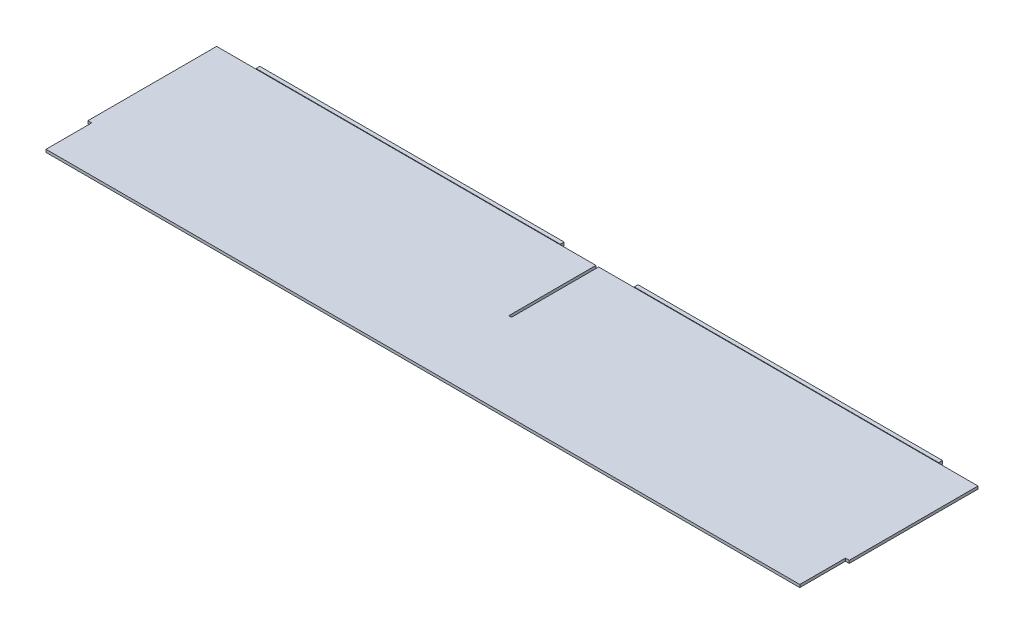
ISO-10303-21;
HEADER;
FILE_DESCRIPTION(('STEP AP214'),'2;1');
FILE_NAME('part.step','',(''),(''),'','','');
FILE_SCHEMA(('AUTOMOTIVE_DESIGN { 1 0 10303 214 1 1 1 1 }'));
ENDSEC;
DATA;
#1=APPLICATION_CONTEXT('core data for automotive mechanical design processes');
#2=APPLICATION_PROTOCOL_DEFINITION('international standard','automotive_design',2000,#1);
#3=PRODUCT_CONTEXT('',#1,'mechanical');
#4=PRODUCT('Part','Part','',(#3));
#5=PRODUCT_RELATED_PRODUCT_CATEGORY('part','',(#4));
#6=PRODUCT_DEFINITION_FORMATION('','',#4);
#7=PRODUCT_DEFINITION_CONTEXT('part definition',#1,'design');
#8=PRODUCT_DEFINITION('design','',#6,#7);
#9=PRODUCT_DEFINITION_SHAPE('','',#8);
#10=(LENGTH_UNIT() NAMED_UNIT(*) SI_UNIT(.MILLI.,.METRE.));
#11=(NAMED_UNIT(*) PLANE_ANGLE_UNIT() SI_UNIT($,.RADIAN.));
#12=(NAMED_UNIT(*) SI_UNIT($,.STERADIAN.) SOLID_ANGLE_UNIT());
#13=UNCERTAINTY_MEASURE_WITH_UNIT(LENGTH_MEASURE(1.E-05),#10,'distance_accuracy_value','');
#14=(GEOMETRIC_REPRESENTATION_CONTEXT(3) GLOBAL_UNCERTAINTY_ASSIGNED_CONTEXT((#13)) GLOBAL_UNIT_ASSIGNED_CONTEXT((#10,
#11,#12)) REPRESENTATION_CONTEXT('',''));
#15=CARTESIAN_POINT('',(0.,0.,0.));
#16=DIRECTION('',(0.,0.,1.));
#17=DIRECTION('',(1.,0.,0.));
#18=AXIS2_PLACEMENT_3D('',#15,#16,#17);
#19=CARTESIAN_POINT('',(-317.6778,1.143,-72.771));
#20=DIRECTION('',(0.,0.,1.));
#21=DIRECTION('',(1.,0.,0.));
#22=AXIS2_PLACEMENT_3D('',#19,#20,#21);
#23=PLANE('',#22);
#24=DIRECTION('',(-1.,0.,0.));
#25=VECTOR('',#24,1.);
#26=CARTESIAN_POINT('',(-317.6778,1.143,-72.771));
#27=LINE('',#26,#25);
#28=CARTESIAN_POINT('',(-1.14299999999998,1.143,-72.771));
#29=VERTEX_POINT('',#28);
#30=CARTESIAN_POINT('',(-30.8229000000015,1.143,-72.771));
#31=VERTEX_POINT('',#30);
#32=EDGE_CURVE('E200',#29,#31,#27,.T.);
#33=ORIENTED_EDGE('',*,*,#32,.F.);
#34=DIRECTION('',(0.,-1.,0.));
#35=VECTOR('',#34,1.);
#36=CARTESIAN_POINT('',(-1.14300000000001,1.143,-72.771));
#37=LINE('',#36,#35);
#38=CARTESIAN_POINT('',(-1.14299999999998,-1.143,-72.771));
#39=VERTEX_POINT('',#38);
#40=EDGE_CURVE('E11',#29,#39,#37,.T.);
#41=ORIENTED_EDGE('',*,*,#40,.T.);
#42=DIRECTION('',(-1.,0.,0.));
#43=VECTOR('',#42,1.);
#44=CARTESIAN_POINT('',(-317.6778,-1.143,-72.771));
#45=LINE('',#44,#43);
#46=CARTESIAN_POINT('',(-30.8229000000015,-1.143,-72.771));
#47=VERTEX_POINT('',#46);
#48=EDGE_CURVE('E198',#39,#47,#45,.T.);
#49=ORIENTED_EDGE('',*,*,#48,.T.);
#50=DIRECTION('',(0.,-1.,0.));
#51=VECTOR('',#50,1.);
#52=CARTESIAN_POINT('',(-30.8229000000015,-1.143,-72.771));
#53=LINE('',#52,#51);
#54=EDGE_CURVE('E232',#31,#47,#53,.T.);
#55=ORIENTED_EDGE('',*,*,#54,.F.);
#56=EDGE_LOOP('',(#33,#41,#49,#55));
#57=FACE_BOUND('',#56,.T.);
#58=ADVANCED_FACE('F34',(#57),#23,.F.);
#59=CARTESIAN_POINT('',(317.6778,1.143,-72.771));
#60=DIRECTION('',(-1.,0.,0.));
#61=DIRECTION('',(0.,0.,1.));
#62=AXIS2_PLACEMENT_3D('',#59,#60,#61);
#63=PLANE('',#62);
#64=DIRECTION('',(0.,-1.,0.));
#65=VECTOR('',#64,1.);
#66=CARTESIAN_POINT('',(317.6778,1.58749999999994,34.671));
#67=LINE('',#66,#65);
#68=CARTESIAN_POINT('',(317.6778,1.143,34.671));
#69=VERTEX_POINT('',#68);
#70=CARTESIAN_POINT('',(317.6778,-1.143,34.671));
#71=VERTEX_POINT('',#70);
#72=EDGE_CURVE('E298',#69,#71,#67,.T.);
#73=ORIENTED_EDGE('',*,*,#72,.T.);
#74=DIRECTION('',(0.,0.,-1.));
#75=VECTOR('',#74,1.);
#76=CARTESIAN_POINT('',(317.6778,-1.143,-72.771));
#77=LINE('',#76,#75);
#78=CARTESIAN_POINT('',(317.6778,-1.143,-72.771));
#79=VERTEX_POINT('',#78);
#80=EDGE_CURVE('E210',#71,#79,#77,.T.);
#81=ORIENTED_EDGE('',*,*,#80,.T.);
#82=DIRECTION('',(0.,-1.,0.));
#83=VECTOR('',#82,1.);
#84=CARTESIAN_POINT('',(317.6778,1.143,-72.771));
#85=LINE('',#84,#83);
#86=CARTESIAN_POINT('',(317.6778,1.143,-72.771));
#87=VERTEX_POINT('',#86);
#88=EDGE_CURVE('E230',#87,#79,#85,.T.);
#89=ORIENTED_EDGE('',*,*,#88,.F.);
#90=DIRECTION('',(0.,0.,-1.));
#91=VECTOR('',#90,1.);
#92=CARTESIAN_POINT('',(317.6778,1.143,-72.771));
#93=LINE('',#92,#91);
#94=EDGE_CURVE('E225',#69,#87,#93,.T.);
#95=ORIENTED_EDGE('',*,*,#94,.F.);
#96=EDGE_LOOP('',(#73,#81,#89,#95));
#97=FACE_BOUND('',#96,.T.);
#98=ADVANCED_FACE('F36',(#97),#63,.F.);
#99=CARTESIAN_POINT('',(-317.6778,1.143,72.771));
#100=DIRECTION('',(0.,0.,-1.));
#101=DIRECTION('',(-1.,0.,0.));
#102=AXIS2_PLACEMENT_3D('',#99,#100,#101);
#103=PLANE('',#102);
#104=DIRECTION('',(0.,-1.,0.));
#105=VECTOR('',#104,1.);
#106=CARTESIAN_POINT('',(314.5028,1.58749999999994,72.771));
#107=LINE('',#106,#105);
#108=CARTESIAN_POINT('',(314.5028,1.143,72.771));
#109=VERTEX_POINT('',#108);
#110=CARTESIAN_POINT('',(314.5028,-1.143,72.771));
#111=VERTEX_POINT('',#110);
#112=EDGE_CURVE('E57',#109,#111,#107,.T.);
#113=ORIENTED_EDGE('',*,*,#112,.F.);
#114=DIRECTION('',(1.,0.,0.));
#115=VECTOR('',#114,1.);
#116=CARTESIAN_POINT('',(-317.6778,1.143,72.771));
#117=LINE('',#116,#115);
#118=CARTESIAN_POINT('',(-314.5028,1.143,72.771));
#119=VERTEX_POINT('',#118);
#120=EDGE_CURVE('E231',#119,#109,#117,.T.);
#121=ORIENTED_EDGE('',*,*,#120,.F.);
#122=DIRECTION('',(0.,-1.,0.));
#123=VECTOR('',#122,1.);
#124=CARTESIAN_POINT('',(-314.5028,1.58749999999994,72.771));
#125=LINE('',#124,#123);
#126=CARTESIAN_POINT('',(-314.5028,-1.143,72.771));
#127=VERTEX_POINT('',#126);
#128=EDGE_CURVE('E322',#119,#127,#125,.T.);
#129=ORIENTED_EDGE('',*,*,#128,.T.);
#130=DIRECTION('',(1.,0.,0.));
#131=VECTOR('',#130,1.);
#132=CARTESIAN_POINT('',(-317.6778,-1.143,72.771));
#133=LINE('',#132,#131);
#134=EDGE_CURVE('E219',#127,#111,#133,.T.);
#135=ORIENTED_EDGE('',*,*,#134,.T.);
#136=EDGE_LOOP('',(#113,#121,#129,#135));
#137=FACE_BOUND('',#136,.T.);
#138=ADVANCED_FACE('F397',(#137),#103,.F.);
#139=CARTESIAN_POINT('',(0.,1.143,0.));
#140=DIRECTION('',(0.,1.,0.));
#141=DIRECTION('',(0.,0.,1.));
#142=AXIS2_PLACEMENT_3D('',#139,#140,#141);
#143=PLANE('',#142);
#144=DIRECTION('',(0.,0.,1.));
#145=VECTOR('',#144,1.);
#146=CARTESIAN_POINT('',(-1.14299999999998,1.143,0.));
#147=LINE('',#146,#145);
#148=CARTESIAN_POINT('',(-1.14299999999998,1.143,0.));
#149=VERTEX_POINT('',#148);
#150=EDGE_CURVE('E403',#29,#149,#147,.T.);
#151=ORIENTED_EDGE('',*,*,#150,.F.);
#152=ORIENTED_EDGE('',*,*,#32,.T.);
#153=CARTESIAN_POINT('',(-284.822900000001,1.143,-72.771));
#154=VERTEX_POINT('',#153);
#155=EDGE_CURVE('E289',#31,#154,#27,.T.);
#156=ORIENTED_EDGE('',*,*,#155,.T.);
#157=CARTESIAN_POINT('',(-317.6778,1.143,-72.771));
#158=VERTEX_POINT('',#157);
#159=EDGE_CURVE('E283',#154,#158,#27,.T.);
#160=ORIENTED_EDGE('',*,*,#159,.T.);
#161=DIRECTION('',(0.,0.,1.));
#162=VECTOR('',#161,1.);
#163=CARTESIAN_POINT('',(-317.6778,1.143,-72.771));
#164=LINE('',#163,#162);
#165=CARTESIAN_POINT('',(-317.6778,1.143,34.671));
#166=VERTEX_POINT('',#165);
#167=EDGE_CURVE('E287',#158,#166,#164,.T.);
#168=ORIENTED_EDGE('',*,*,#167,.T.);
#169=DIRECTION('',(-1.,0.,0.));
#170=VECTOR('',#169,1.);
#171=CARTESIAN_POINT('',(0.,1.143,34.671));
#172=LINE('',#171,#170);
#173=CARTESIAN_POINT('',(-314.5028,1.143,34.671));
#174=VERTEX_POINT('',#173);
#175=EDGE_CURVE('E325',#174,#166,#172,.T.);
#176=ORIENTED_EDGE('',*,*,#175,.F.);
#177=DIRECTION('',(0.,0.,-1.));
#178=VECTOR('',#177,1.);
#179=CARTESIAN_POINT('',(-314.5028,1.143,0.));
#180=LINE('',#179,#178);
#181=EDGE_CURVE('E330',#119,#174,#180,.T.);
#182=ORIENTED_EDGE('',*,*,#181,.F.);
#183=ORIENTED_EDGE('',*,*,#120,.T.);
#184=DIRECTION('',(0.,0.,-1.));
#185=VECTOR('',#184,1.);
#186=CARTESIAN_POINT('',(314.5028,1.143,0.));
#187=LINE('',#186,#185);
#188=CARTESIAN_POINT('',(314.5028,1.143,34.671));
#189=VERTEX_POINT('',#188);
#190=EDGE_CURVE('E309',#109,#189,#187,.T.);
#191=ORIENTED_EDGE('',*,*,#190,.T.);
#192=DIRECTION('',(1.,0.,0.));
#193=VECTOR('',#192,1.);
#194=CARTESIAN_POINT('',(0.,1.143,34.671));
#195=LINE('',#194,#193);
#196=EDGE_CURVE('E308',#189,#69,#195,.T.);
#197=ORIENTED_EDGE('',*,*,#196,.T.);
#198=ORIENTED_EDGE('',*,*,#94,.T.);
#199=CARTESIAN_POINT('',(284.822900000001,1.143,-72.771));
#200=VERTEX_POINT('',#199);
#201=EDGE_CURVE('E284',#87,#200,#27,.T.);
#202=ORIENTED_EDGE('',*,*,#201,.T.);
#203=DIRECTION('',(1.,0.,0.));
#204=VECTOR('',#203,1.);
#205=CARTESIAN_POINT('',(0.,1.143,-72.771));
#206=LINE('',#205,#204);
#207=CARTESIAN_POINT('',(30.8229000000014,1.143,-72.771));
#208=VERTEX_POINT('',#207);
#209=EDGE_CURVE('E242',#208,#200,#206,.T.);
#210=ORIENTED_EDGE('',*,*,#209,.F.);
#211=CARTESIAN_POINT('',(1.14300000000001,1.143,-72.771));
#212=VERTEX_POINT('',#211);
#213=EDGE_CURVE('E288',#208,#212,#27,.T.);
#214=ORIENTED_EDGE('',*,*,#213,.T.);
#215=DIRECTION('',(0.,0.,-1.));
#216=VECTOR('',#215,1.);
#217=CARTESIAN_POINT('',(1.14300000000002,1.143,0.));
#218=LINE('',#217,#216);
#219=CARTESIAN_POINT('',(1.14300000000002,1.143,0.));
#220=VERTEX_POINT('',#219);
#221=EDGE_CURVE('E49',#220,#212,#218,.T.);
#222=ORIENTED_EDGE('',*,*,#221,.F.);
#223=DIRECTION('',(1.,0.,0.));
#224=VECTOR('',#223,1.);
#225=CARTESIAN_POINT('',(0.,1.143,0.));
#226=LINE('',#225,#224);
#227=EDGE_CURVE('E400',#149,#220,#226,.T.);
#228=ORIENTED_EDGE('',*,*,#227,.F.);
#229=EDGE_LOOP('',(#151,#152,#156,#160,#168,#176,#182,#183,#191,#197,#198,#202,#210,#214,#222,#228));
#230=FACE_BOUND('',#229,.T.);
#231=ADVANCED_FACE('F305',(#230),#143,.T.);
#232=CARTESIAN_POINT('',(0.,-1.143,0.));
#233=DIRECTION('',(0.,1.,0.));
#234=DIRECTION('',(0.,0.,1.));
#235=AXIS2_PLACEMENT_3D('',#232,#233,#234);
#236=PLANE('',#235);
#237=ORIENTED_EDGE('',*,*,#48,.F.);
#238=DIRECTION('',(0.,0.,-1.));
#239=VECTOR('',#238,1.);
#240=CARTESIAN_POINT('',(-1.14299999999998,-1.143,-72.771));
#241=LINE('',#240,#239);
#242=CARTESIAN_POINT('',(-1.14299999999998,-1.143,0.));
#243=VERTEX_POINT('',#242);
#244=EDGE_CURVE('E184',#243,#39,#241,.T.);
#245=ORIENTED_EDGE('',*,*,#244,.F.);
#246=DIRECTION('',(-1.,0.,0.));
#247=VECTOR('',#246,1.);
#248=CARTESIAN_POINT('',(-1.14299999999998,-1.143,0.));
#249=LINE('',#248,#247);
#250=CARTESIAN_POINT('',(1.14300000000002,-1.143,0.));
#251=VERTEX_POINT('',#250);
#252=EDGE_CURVE('E549',#251,#243,#249,.T.);
#253=ORIENTED_EDGE('',*,*,#252,.F.);
#254=DIRECTION('',(0.,0.,1.));
#255=VECTOR('',#254,1.);
#256=CARTESIAN_POINT('',(1.14300000000002,-1.143,-72.771));
#257=LINE('',#256,#255);
#258=CARTESIAN_POINT('',(1.14300000000002,-1.143,-72.771));
#259=VERTEX_POINT('',#258);
#260=EDGE_CURVE('E193',#259,#251,#257,.T.);
#261=ORIENTED_EDGE('',*,*,#260,.F.);
#262=CARTESIAN_POINT('',(30.8229000000015,-1.143,-72.771));
#263=VERTEX_POINT('',#262);
#264=EDGE_CURVE('E205',#263,#259,#45,.T.);
#265=ORIENTED_EDGE('',*,*,#264,.F.);
#266=DIRECTION('',(0.,0.,1.));
#267=VECTOR('',#266,1.);
#268=CARTESIAN_POINT('',(30.8229000000015,-1.143,-75.946));
#269=LINE('',#268,#267);
#270=CARTESIAN_POINT('',(30.8229000000015,-1.143,-75.946));
#271=VERTEX_POINT('',#270);
#272=EDGE_CURVE('E255',#271,#263,#269,.T.);
#273=ORIENTED_EDGE('',*,*,#272,.F.);
#274=DIRECTION('',(-1.,0.,0.));
#275=VECTOR('',#274,1.);
#276=CARTESIAN_POINT('',(284.822900000001,-1.143,-75.946));
#277=LINE('',#276,#275);
#278=CARTESIAN_POINT('',(284.822900000001,-1.143,-75.946));
#279=VERTEX_POINT('',#278);
#280=EDGE_CURVE('E335',#279,#271,#277,.T.);
#281=ORIENTED_EDGE('',*,*,#280,.F.);
#282=DIRECTION('',(0.,0.,1.));
#283=VECTOR('',#282,1.);
#284=CARTESIAN_POINT('',(284.822900000001,-1.143,-75.946));
#285=LINE('',#284,#283);
#286=CARTESIAN_POINT('',(284.822900000001,-1.143,-72.771));
#287=VERTEX_POINT('',#286);
#288=EDGE_CURVE('E247',#279,#287,#285,.T.);
#289=ORIENTED_EDGE('',*,*,#288,.T.);
#290=EDGE_CURVE('E208',#79,#287,#45,.T.);
#291=ORIENTED_EDGE('',*,*,#290,.F.);
#292=ORIENTED_EDGE('',*,*,#80,.F.);
#293=DIRECTION('',(-1.,0.,0.));
#294=VECTOR('',#293,1.);
#295=CARTESIAN_POINT('',(317.6778,-1.143,34.671));
#296=LINE('',#295,#294);
#297=CARTESIAN_POINT('',(314.5028,-1.143,34.671));
#298=VERTEX_POINT('',#297);
#299=EDGE_CURVE('E399',#71,#298,#296,.T.);
#300=ORIENTED_EDGE('',*,*,#299,.T.);
#301=DIRECTION('',(0.,0.,1.));
#302=VECTOR('',#301,1.);
#303=CARTESIAN_POINT('',(314.5028,-1.143,72.771));
#304=LINE('',#303,#302);
#305=EDGE_CURVE('E398',#298,#111,#304,.T.);
#306=ORIENTED_EDGE('',*,*,#305,.T.);
#307=ORIENTED_EDGE('',*,*,#134,.F.);
#308=DIRECTION('',(0.,0.,1.));
#309=VECTOR('',#308,1.);
#310=CARTESIAN_POINT('',(-314.5028,-1.143,72.771));
#311=LINE('',#310,#309);
#312=CARTESIAN_POINT('',(-314.5028,-1.143,34.671));
#313=VERTEX_POINT('',#312);
#314=EDGE_CURVE('E315',#313,#127,#311,.T.);
#315=ORIENTED_EDGE('',*,*,#314,.F.);
#316=DIRECTION('',(1.,0.,0.));
#317=VECTOR('',#316,1.);
#318=CARTESIAN_POINT('',(-317.6778,-1.143,34.671));
#319=LINE('',#318,#317);
#320=CARTESIAN_POINT('',(-317.6778,-1.143,34.671));
#321=VERTEX_POINT('',#320);
#322=EDGE_CURVE('E312',#321,#313,#319,.T.);
#323=ORIENTED_EDGE('',*,*,#322,.F.);
#324=DIRECTION('',(0.,0.,1.));
#325=VECTOR('',#324,1.);
#326=CARTESIAN_POINT('',(-317.6778,-1.143,-72.771));
#327=LINE('',#326,#325);
#328=CARTESIAN_POINT('',(-317.6778,-1.143,-72.771));
#329=VERTEX_POINT('',#328);
#330=EDGE_CURVE('E213',#329,#321,#327,.T.);
#331=ORIENTED_EDGE('',*,*,#330,.F.);
#332=CARTESIAN_POINT('',(-284.822900000001,-1.143,-72.771));
#333=VERTEX_POINT('',#332);
#334=EDGE_CURVE('E206',#333,#329,#45,.T.);
#335=ORIENTED_EDGE('',*,*,#334,.F.);
#336=DIRECTION('',(0.,0.,1.));
#337=VECTOR('',#336,1.);
#338=CARTESIAN_POINT('',(-284.822900000001,-1.143,-75.946));
#339=LINE('',#338,#337);
#340=CARTESIAN_POINT('',(-284.822900000001,-1.143,-75.946));
#341=VERTEX_POINT('',#340);
#342=EDGE_CURVE('E275',#341,#333,#339,.T.);
#343=ORIENTED_EDGE('',*,*,#342,.F.);
#344=DIRECTION('',(-1.,0.,0.));
#345=VECTOR('',#344,1.);
#346=CARTESIAN_POINT('',(-30.8229000000015,-1.143,-75.946));
#347=LINE('',#346,#345);
#348=CARTESIAN_POINT('',(-30.8229000000015,-1.143,-75.946));
#349=VERTEX_POINT('',#348);
#350=EDGE_CURVE('E262',#349,#341,#347,.T.);
#351=ORIENTED_EDGE('',*,*,#350,.F.);
#352=DIRECTION('',(0.,0.,1.));
#353=VECTOR('',#352,1.);
#354=CARTESIAN_POINT('',(-30.8229000000015,-1.143,-75.946));
#355=LINE('',#354,#353);
#356=EDGE_CURVE('E204',#349,#47,#355,.T.);
#357=ORIENTED_EDGE('',*,*,#356,.T.);
#358=EDGE_LOOP('',(#237,#245,#253,#261,#265,#273,#281,#289,#291,#292,#300,#306,#307,#315,#323,
#331,#335,#343,#351,#357));
#359=FACE_BOUND('',#358,.T.);
#360=ADVANCED_FACE('F202',(#359),#236,.F.);
#361=DIRECTION('',(0.,-1.,0.));
#362=VECTOR('',#361,1.);
#363=CARTESIAN_POINT('',(284.822900000001,-1.143,-72.771));
#364=LINE('',#363,#362);
#365=EDGE_CURVE('E303',#200,#287,#364,.T.);
#366=ORIENTED_EDGE('',*,*,#365,.F.);
#367=ORIENTED_EDGE('',*,*,#201,.F.);
#368=ORIENTED_EDGE('',*,*,#88,.T.);
#369=ORIENTED_EDGE('',*,*,#290,.T.);
#370=EDGE_LOOP('',(#366,#367,#368,#369));
#371=FACE_BOUND('',#370,.T.);
#372=ADVANCED_FACE('F302',(#371),#23,.F.);
#373=ORIENTED_EDGE('',*,*,#264,.T.);
#374=DIRECTION('',(0.,1.,0.));
#375=VECTOR('',#374,1.);
#376=CARTESIAN_POINT('',(1.14300000000001,1.143,-72.771));
#377=LINE('',#376,#375);
#378=EDGE_CURVE('E42',#259,#212,#377,.T.);
#379=ORIENTED_EDGE('',*,*,#378,.T.);
#380=ORIENTED_EDGE('',*,*,#213,.F.);
#381=DIRECTION('',(0.,1.,0.));
#382=VECTOR('',#381,1.);
#383=CARTESIAN_POINT('',(30.8229000000015,1.58749999999994,-72.771));
#384=LINE('',#383,#382);
#385=EDGE_CURVE('E346',#263,#208,#384,.T.);
#386=ORIENTED_EDGE('',*,*,#385,.F.);
#387=EDGE_LOOP('',(#373,#379,#380,#386));
#388=FACE_BOUND('',#387,.T.);
#389=ADVANCED_FACE('F363',(#388),#23,.F.);
#390=DIRECTION('',(0.,1.,0.));
#391=VECTOR('',#390,1.);
#392=CARTESIAN_POINT('',(-284.822900000001,1.58749999999994,-72.771));
#393=LINE('',#392,#391);
#394=EDGE_CURVE('E245',#333,#154,#393,.T.);
#395=ORIENTED_EDGE('',*,*,#394,.F.);
#396=ORIENTED_EDGE('',*,*,#334,.T.);
#397=DIRECTION('',(0.,-1.,0.));
#398=VECTOR('',#397,1.);
#399=CARTESIAN_POINT('',(-317.6778,1.143,-72.771));
#400=LINE('',#399,#398);
#401=EDGE_CURVE('E228',#158,#329,#400,.T.);
#402=ORIENTED_EDGE('',*,*,#401,.F.);
#403=ORIENTED_EDGE('',*,*,#159,.F.);
#404=EDGE_LOOP('',(#395,#396,#402,#403));
#405=FACE_BOUND('',#404,.T.);
#406=ADVANCED_FACE('F370',(#405),#23,.F.);
#407=CARTESIAN_POINT('',(-317.6778,1.143,-72.771));
#408=DIRECTION('',(1.,0.,0.));
#409=DIRECTION('',(0.,0.,-1.));
#410=AXIS2_PLACEMENT_3D('',#407,#408,#409);
#411=PLANE('',#410);
#412=ORIENTED_EDGE('',*,*,#330,.T.);
#413=DIRECTION('',(0.,-1.,0.));
#414=VECTOR('',#413,1.);
#415=CARTESIAN_POINT('',(-317.6778,1.58749999999994,34.671));
#416=LINE('',#415,#414);
#417=EDGE_CURVE('E321',#166,#321,#416,.T.);
#418=ORIENTED_EDGE('',*,*,#417,.F.);
#419=ORIENTED_EDGE('',*,*,#167,.F.);
#420=ORIENTED_EDGE('',*,*,#401,.T.);
#421=EDGE_LOOP('',(#412,#418,#419,#420));
#422=FACE_BOUND('',#421,.T.);
#423=ADVANCED_FACE('F385',(#422),#411,.F.);
#424=CARTESIAN_POINT('',(0.,0.,-72.771));
#425=DIRECTION('',(0.,0.,1.));
#426=DIRECTION('',(1.,0.,0.));
#427=AXIS2_PLACEMENT_3D('',#424,#425,#426);
#428=PLANE('',#427);
#429=ORIENTED_EDGE('',*,*,#155,.F.);
#430=CARTESIAN_POINT('',(-30.8229000000015,1.58749999999994,-72.771));
#431=VERTEX_POINT('',#430);
#432=EDGE_CURVE('E236',#431,#31,#53,.T.);
#433=ORIENTED_EDGE('',*,*,#432,.F.);
#434=DIRECTION('',(1.,0.,0.));
#435=VECTOR('',#434,1.);
#436=CARTESIAN_POINT('',(-30.8229000000015,1.58749999999994,-72.771));
#437=LINE('',#436,#435);
#438=CARTESIAN_POINT('',(-284.822900000001,1.58749999999994,-72.771));
#439=VERTEX_POINT('',#438);
#440=EDGE_CURVE('E263',#439,#431,#437,.T.);
#441=ORIENTED_EDGE('',*,*,#440,.F.);
#442=EDGE_CURVE('E241',#154,#439,#393,.T.);
#443=ORIENTED_EDGE('',*,*,#442,.F.);
#444=EDGE_LOOP('',(#429,#433,#441,#443));
#445=FACE_BOUND('',#444,.T.);
#446=ADVANCED_FACE('F375',(#445),#428,.T.);
#447=CARTESIAN_POINT('',(-30.8229000000015,-1.143,-75.946));
#448=DIRECTION('',(-1.,0.,0.));
#449=DIRECTION('',(0.,0.,1.));
#450=AXIS2_PLACEMENT_3D('',#447,#448,#449);
#451=PLANE('',#450);
#452=ORIENTED_EDGE('',*,*,#432,.T.);
#453=ORIENTED_EDGE('',*,*,#54,.T.);
#454=ORIENTED_EDGE('',*,*,#356,.F.);
#455=DIRECTION('',(0.,-1.,0.));
#456=VECTOR('',#455,1.);
#457=CARTESIAN_POINT('',(-30.8229000000015,-1.143,-75.946));
#458=LINE('',#457,#456);
#459=CARTESIAN_POINT('',(-30.8229000000015,1.58749999999994,-75.946));
#460=VERTEX_POINT('',#459);
#461=EDGE_CURVE('E259',#460,#349,#458,.T.);
#462=ORIENTED_EDGE('',*,*,#461,.F.);
#463=DIRECTION('',(0.,0.,1.));
#464=VECTOR('',#463,1.);
#465=CARTESIAN_POINT('',(-30.8229000000015,1.58749999999994,-75.946));
#466=LINE('',#465,#464);
#467=EDGE_CURVE('E267',#460,#431,#466,.T.);
#468=ORIENTED_EDGE('',*,*,#467,.T.);
#469=EDGE_LOOP('',(#452,#453,#454,#462,#468));
#470=FACE_BOUND('',#469,.T.);
#471=ADVANCED_FACE('F439',(#470),#451,.F.);
#472=CARTESIAN_POINT('',(-284.822900000001,1.58749999999994,-75.946));
#473=DIRECTION('',(1.,0.,0.));
#474=DIRECTION('',(0.,1.,0.));
#475=AXIS2_PLACEMENT_3D('',#472,#473,#474);
#476=PLANE('',#475);
#477=ORIENTED_EDGE('',*,*,#394,.T.);
#478=ORIENTED_EDGE('',*,*,#442,.T.);
#479=DIRECTION('',(0.,0.,1.));
#480=VECTOR('',#479,1.);
#481=CARTESIAN_POINT('',(-284.822900000001,1.58749999999994,-75.946));
#482=LINE('',#481,#480);
#483=CARTESIAN_POINT('',(-284.822900000001,1.58749999999994,-75.946));
#484=VERTEX_POINT('',#483);
#485=EDGE_CURVE('E271',#484,#439,#482,.T.);
#486=ORIENTED_EDGE('',*,*,#485,.F.);
#487=DIRECTION('',(0.,1.,0.));
#488=VECTOR('',#487,1.);
#489=CARTESIAN_POINT('',(-284.822900000001,1.58749999999994,-75.946));
#490=LINE('',#489,#488);
#491=EDGE_CURVE('E265',#341,#484,#490,.T.);
#492=ORIENTED_EDGE('',*,*,#491,.F.);
#493=ORIENTED_EDGE('',*,*,#342,.T.);
#494=EDGE_LOOP('',(#477,#478,#486,#492,#493));
#495=FACE_BOUND('',#494,.T.);
#496=ADVANCED_FACE('F378',(#495),#476,.F.);
#497=CARTESIAN_POINT('',(-30.8229000000015,1.58749999999994,-75.946));
#498=DIRECTION('',(0.,-1.,0.));
#499=DIRECTION('',(0.,0.,-1.));
#500=AXIS2_PLACEMENT_3D('',#497,#498,#499);
#501=PLANE('',#500);
#502=ORIENTED_EDGE('',*,*,#440,.T.);
#503=ORIENTED_EDGE('',*,*,#467,.F.);
#504=DIRECTION('',(1.,0.,0.));
#505=VECTOR('',#504,1.);
#506=CARTESIAN_POINT('',(-30.8229000000015,1.58749999999994,-75.946));
#507=LINE('',#506,#505);
#508=EDGE_CURVE('E266',#484,#460,#507,.T.);
#509=ORIENTED_EDGE('',*,*,#508,.F.);
#510=ORIENTED_EDGE('',*,*,#485,.T.);
#511=EDGE_LOOP('',(#502,#503,#509,#510));
#512=FACE_BOUND('',#511,.T.);
#513=ADVANCED_FACE('F382',(#512),#501,.F.);
#514=CARTESIAN_POINT('',(0.,0.,-75.946));
#515=DIRECTION('',(0.,0.,1.));
#516=DIRECTION('',(1.,0.,0.));
#517=AXIS2_PLACEMENT_3D('',#514,#515,#516);
#518=PLANE('',#517);
#519=ORIENTED_EDGE('',*,*,#461,.T.);
#520=ORIENTED_EDGE('',*,*,#350,.T.);
#521=ORIENTED_EDGE('',*,*,#491,.T.);
#522=ORIENTED_EDGE('',*,*,#508,.T.);
#523=EDGE_LOOP('',(#519,#520,#521,#522));
#524=FACE_BOUND('',#523,.T.);
#525=ADVANCED_FACE('F383',(#524),#518,.F.);
#526=CARTESIAN_POINT('',(284.822900000001,-1.143,-75.946));
#527=DIRECTION('',(-1.,0.,0.));
#528=DIRECTION('',(0.,-1.,0.));
#529=AXIS2_PLACEMENT_3D('',#526,#527,#528);
#530=PLANE('',#529);
#531=CARTESIAN_POINT('',(284.822900000001,1.58749999999994,-72.771));
#532=VERTEX_POINT('',#531);
#533=EDGE_CURVE('E343',#532,#200,#364,.T.);
#534=ORIENTED_EDGE('',*,*,#533,.T.);
#535=ORIENTED_EDGE('',*,*,#365,.T.);
#536=ORIENTED_EDGE('',*,*,#288,.F.);
#537=DIRECTION('',(0.,-1.,0.));
#538=VECTOR('',#537,1.);
#539=CARTESIAN_POINT('',(284.822900000001,-1.143,-75.946));
#540=LINE('',#539,#538);
#541=CARTESIAN_POINT('',(284.822900000001,1.58749999999994,-75.946));
#542=VERTEX_POINT('',#541);
#543=EDGE_CURVE('E332',#542,#279,#540,.T.);
#544=ORIENTED_EDGE('',*,*,#543,.F.);
#545=DIRECTION('',(0.,0.,1.));
#546=VECTOR('',#545,1.);
#547=CARTESIAN_POINT('',(284.822900000001,1.58749999999994,-75.946));
#548=LINE('',#547,#546);
#549=EDGE_CURVE('E342',#542,#532,#548,.T.);
#550=ORIENTED_EDGE('',*,*,#549,.T.);
#551=EDGE_LOOP('',(#534,#535,#536,#544,#550));
#552=FACE_BOUND('',#551,.T.);
#553=ADVANCED_FACE('F454',(#552),#530,.F.);
#554=CARTESIAN_POINT('',(30.8229000000015,1.58749999999994,-75.946));
#555=DIRECTION('',(1.,0.,0.));
#556=DIRECTION('',(0.,0.,-1.));
#557=AXIS2_PLACEMENT_3D('',#554,#555,#556);
#558=PLANE('',#557);
#559=ORIENTED_EDGE('',*,*,#385,.T.);
#560=CARTESIAN_POINT('',(30.8229000000015,1.58749999999994,-72.771));
#561=VERTEX_POINT('',#560);
#562=EDGE_CURVE('E345',#208,#561,#384,.T.);
#563=ORIENTED_EDGE('',*,*,#562,.T.);
#564=DIRECTION('',(0.,0.,1.));
#565=VECTOR('',#564,1.);
#566=CARTESIAN_POINT('',(30.8229000000015,1.58749999999994,-75.946));
#567=LINE('',#566,#565);
#568=CARTESIAN_POINT('',(30.8229000000015,1.58749999999994,-75.946));
#569=VERTEX_POINT('',#568);
#570=EDGE_CURVE('E352',#569,#561,#567,.T.);
#571=ORIENTED_EDGE('',*,*,#570,.F.);
#572=DIRECTION('',(0.,1.,0.));
#573=VECTOR('',#572,1.);
#574=CARTESIAN_POINT('',(30.8229000000015,1.58749999999994,-75.946));
#575=LINE('',#574,#573);
#576=EDGE_CURVE('E338',#271,#569,#575,.T.);
#577=ORIENTED_EDGE('',*,*,#576,.F.);
#578=ORIENTED_EDGE('',*,*,#272,.T.);
#579=EDGE_LOOP('',(#559,#563,#571,#577,#578));
#580=FACE_BOUND('',#579,.T.);
#581=ADVANCED_FACE('F358',(#580),#558,.F.);
#582=CARTESIAN_POINT('',(284.822900000001,1.58749999999994,-75.946));
#583=DIRECTION('',(0.,-1.,0.));
#584=DIRECTION('',(0.,0.,-1.));
#585=AXIS2_PLACEMENT_3D('',#582,#583,#584);
#586=PLANE('',#585);
#587=DIRECTION('',(1.,0.,0.));
#588=VECTOR('',#587,1.);
#589=CARTESIAN_POINT('',(284.822900000001,1.58749999999994,-72.771));
#590=LINE('',#589,#588);
#591=EDGE_CURVE('E336',#561,#532,#590,.T.);
#592=ORIENTED_EDGE('',*,*,#591,.T.);
#593=ORIENTED_EDGE('',*,*,#549,.F.);
#594=DIRECTION('',(1.,0.,0.));
#595=VECTOR('',#594,1.);
#596=CARTESIAN_POINT('',(284.822900000001,1.58749999999994,-75.946));
#597=LINE('',#596,#595);
#598=EDGE_CURVE('E340',#569,#542,#597,.T.);
#599=ORIENTED_EDGE('',*,*,#598,.F.);
#600=ORIENTED_EDGE('',*,*,#570,.T.);
#601=EDGE_LOOP('',(#592,#593,#599,#600));
#602=FACE_BOUND('',#601,.T.);
#603=ADVANCED_FACE('F460',(#602),#586,.F.);
#604=CARTESIAN_POINT('',(0.,0.,-75.946));
#605=DIRECTION('',(0.,0.,1.));
#606=DIRECTION('',(1.,0.,0.));
#607=AXIS2_PLACEMENT_3D('',#604,#605,#606);
#608=PLANE('',#607);
#609=ORIENTED_EDGE('',*,*,#543,.T.);
#610=ORIENTED_EDGE('',*,*,#280,.T.);
#611=ORIENTED_EDGE('',*,*,#576,.T.);
#612=ORIENTED_EDGE('',*,*,#598,.T.);
#613=EDGE_LOOP('',(#609,#610,#611,#612));
#614=FACE_BOUND('',#613,.T.);
#615=ADVANCED_FACE('F463',(#614),#608,.F.);
#616=CARTESIAN_POINT('',(0.,0.,-72.771));
#617=DIRECTION('',(0.,0.,1.));
#618=DIRECTION('',(1.,0.,0.));
#619=AXIS2_PLACEMENT_3D('',#616,#617,#618);
#620=PLANE('',#619);
#621=ORIENTED_EDGE('',*,*,#562,.F.);
#622=ORIENTED_EDGE('',*,*,#209,.T.);
#623=ORIENTED_EDGE('',*,*,#533,.F.);
#624=ORIENTED_EDGE('',*,*,#591,.F.);
#625=EDGE_LOOP('',(#621,#622,#623,#624));
#626=FACE_BOUND('',#625,.T.);
#627=ADVANCED_FACE('F465',(#626),#620,.T.);
#628=CARTESIAN_POINT('',(-314.5028,1.58749999999994,72.771));
#629=DIRECTION('',(1.,0.,0.));
#630=DIRECTION('',(0.,0.,-1.));
#631=AXIS2_PLACEMENT_3D('',#628,#629,#630);
#632=PLANE('',#631);
#633=ORIENTED_EDGE('',*,*,#181,.T.);
#634=DIRECTION('',(0.,-1.,0.));
#635=VECTOR('',#634,1.);
#636=CARTESIAN_POINT('',(-314.5028,1.58749999999994,34.671));
#637=LINE('',#636,#635);
#638=EDGE_CURVE('E326',#174,#313,#637,.T.);
#639=ORIENTED_EDGE('',*,*,#638,.T.);
#640=ORIENTED_EDGE('',*,*,#314,.T.);
#641=ORIENTED_EDGE('',*,*,#128,.F.);
#642=EDGE_LOOP('',(#633,#639,#640,#641));
#643=FACE_BOUND('',#642,.T.);
#644=ADVANCED_FACE('F394',(#643),#632,.F.);
#645=CARTESIAN_POINT('',(-317.6778,1.58749999999994,34.671));
#646=DIRECTION('',(0.,0.,-1.));
#647=DIRECTION('',(-1.,0.,0.));
#648=AXIS2_PLACEMENT_3D('',#645,#646,#647);
#649=PLANE('',#648);
#650=ORIENTED_EDGE('',*,*,#175,.T.);
#651=ORIENTED_EDGE('',*,*,#417,.T.);
#652=ORIENTED_EDGE('',*,*,#322,.T.);
#653=ORIENTED_EDGE('',*,*,#638,.F.);
#654=EDGE_LOOP('',(#650,#651,#652,#653));
#655=FACE_BOUND('',#654,.T.);
#656=ADVANCED_FACE('F391',(#655),#649,.F.);
#657=CARTESIAN_POINT('',(317.6778,1.58749999999994,34.671));
#658=DIRECTION('',(0.,0.,1.));
#659=DIRECTION('',(1.,0.,0.));
#660=AXIS2_PLACEMENT_3D('',#657,#658,#659);
#661=PLANE('',#660);
#662=DIRECTION('',(0.,-1.,0.));
#663=VECTOR('',#662,1.);
#664=CARTESIAN_POINT('',(314.5028,1.58749999999994,34.671));
#665=LINE('',#664,#663);
#666=EDGE_CURVE('E408',#189,#298,#665,.T.);
#667=ORIENTED_EDGE('',*,*,#666,.T.);
#668=ORIENTED_EDGE('',*,*,#299,.F.);
#669=ORIENTED_EDGE('',*,*,#72,.F.);
#670=ORIENTED_EDGE('',*,*,#196,.F.);
#671=EDGE_LOOP('',(#667,#668,#669,#670));
#672=FACE_BOUND('',#671,.T.);
#673=ADVANCED_FACE('F409',(#672),#661,.T.);
#674=CARTESIAN_POINT('',(314.5028,1.58749999999994,72.771));
#675=DIRECTION('',(1.,0.,0.));
#676=DIRECTION('',(0.,0.,-1.));
#677=AXIS2_PLACEMENT_3D('',#674,#675,#676);
#678=PLANE('',#677);
#679=ORIENTED_EDGE('',*,*,#112,.T.);
#680=ORIENTED_EDGE('',*,*,#305,.F.);
#681=ORIENTED_EDGE('',*,*,#666,.F.);
#682=ORIENTED_EDGE('',*,*,#190,.F.);
#683=EDGE_LOOP('',(#679,#680,#681,#682));
#684=FACE_BOUND('',#683,.T.);
#685=ADVANCED_FACE('F410',(#684),#678,.T.);
#686=CARTESIAN_POINT('',(-1.14299999999998,1.58749999999994,-72.771));
#687=DIRECTION('',(-1.,0.,0.));
#688=DIRECTION('',(0.,0.,1.));
#689=AXIS2_PLACEMENT_3D('',#686,#687,#688);
#690=PLANE('',#689);
#691=ORIENTED_EDGE('',*,*,#150,.T.);
#692=DIRECTION('',(0.,-1.,0.));
#693=VECTOR('',#692,1.);
#694=CARTESIAN_POINT('',(-1.14299999999998,1.58749999999994,0.));
#695=LINE('',#694,#693);
#696=EDGE_CURVE('E188',#149,#243,#695,.T.);
#697=ORIENTED_EDGE('',*,*,#696,.T.);
#698=ORIENTED_EDGE('',*,*,#244,.T.);
#699=ORIENTED_EDGE('',*,*,#40,.F.);
#700=EDGE_LOOP('',(#691,#697,#698,#699));
#701=FACE_BOUND('',#700,.T.);
#702=ADVANCED_FACE('F185',(#701),#690,.F.);
#703=CARTESIAN_POINT('',(-1.14299999999998,1.58749999999994,0.));
#704=DIRECTION('',(0.,0.,1.));
#705=DIRECTION('',(1.,0.,0.));
#706=AXIS2_PLACEMENT_3D('',#703,#704,#705);
#707=PLANE('',#706);
#708=ORIENTED_EDGE('',*,*,#227,.T.);
#709=DIRECTION('',(0.,-1.,0.));
#710=VECTOR('',#709,1.);
#711=CARTESIAN_POINT('',(1.14300000000002,1.58749999999994,0.));
#712=LINE('',#711,#710);
#713=EDGE_CURVE('E548',#220,#251,#712,.T.);
#714=ORIENTED_EDGE('',*,*,#713,.T.);
#715=ORIENTED_EDGE('',*,*,#252,.T.);
#716=ORIENTED_EDGE('',*,*,#696,.F.);
#717=EDGE_LOOP('',(#708,#714,#715,#716));
#718=FACE_BOUND('',#717,.T.);
#719=ADVANCED_FACE('F417',(#718),#707,.F.);
#720=CARTESIAN_POINT('',(1.14300000000002,1.58749999999994,-72.771));
#721=DIRECTION('',(1.,0.,0.));
#722=DIRECTION('',(0.,0.,-1.));
#723=AXIS2_PLACEMENT_3D('',#720,#721,#722);
#724=PLANE('',#723);
#725=ORIENTED_EDGE('',*,*,#221,.T.);
#726=ORIENTED_EDGE('',*,*,#378,.F.);
#727=ORIENTED_EDGE('',*,*,#260,.T.);
#728=ORIENTED_EDGE('',*,*,#713,.F.);
#729=EDGE_LOOP('',(#725,#726,#727,#728));
#730=FACE_BOUND('',#729,.T.);
#731=ADVANCED_FACE('F534',(#730),#724,.F.);
#732=CLOSED_SHELL('',(#58,#98,#138,#231,#360,#372,#389,#406,#423,#446,#471,#496,#513,#525,#553,
#581,#603,#615,#627,#644,#656,#673,#685,#702,#719,#731));
#733=MANIFOLD_SOLID_BREP('B2',#732);
#734=ADVANCED_BREP_SHAPE_REPRESENTATION('',(#18,#733),#14);
#735=SHAPE_DEFINITION_REPRESENTATION(#9,#734);
ENDSEC;
END-ISO-10303-21;
